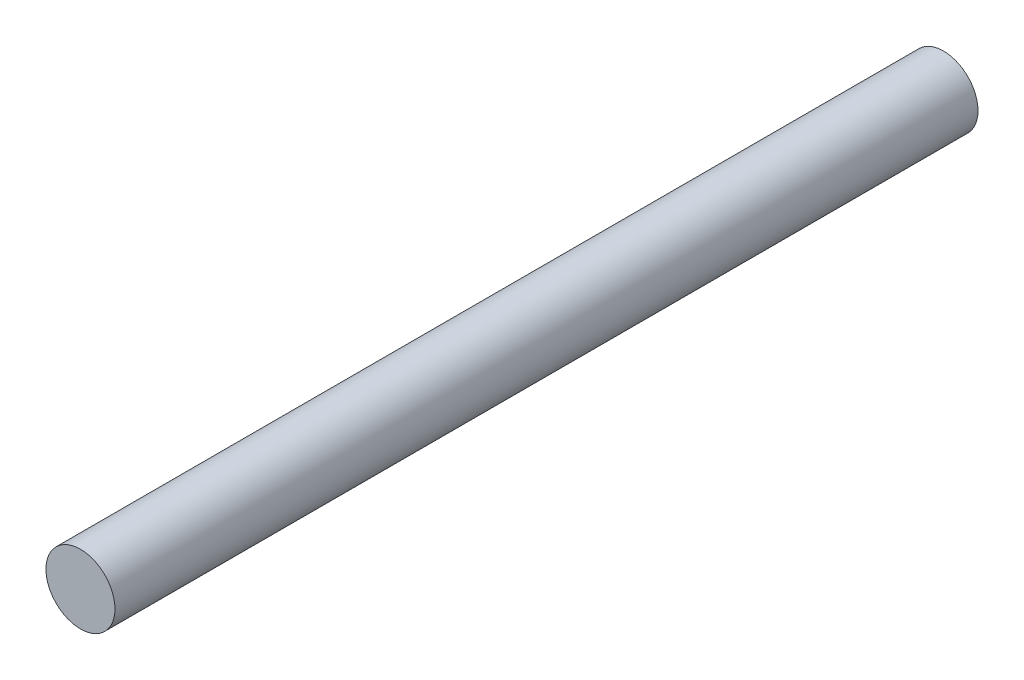
ISO-10303-21;
HEADER;
FILE_DESCRIPTION(('STEP AP214'),'2;1');
FILE_NAME('part.step','',(''),(''),'','','');
FILE_SCHEMA(('AUTOMOTIVE_DESIGN { 1 0 10303 214 1 1 1 1 }'));
ENDSEC;
DATA;
#1=APPLICATION_CONTEXT('core data for automotive mechanical design processes');
#2=APPLICATION_PROTOCOL_DEFINITION('international standard','automotive_design',2000,#1);
#3=PRODUCT_CONTEXT('',#1,'mechanical');
#4=PRODUCT('Part','Part','',(#3));
#5=PRODUCT_RELATED_PRODUCT_CATEGORY('part','',(#4));
#6=PRODUCT_DEFINITION_FORMATION('','',#4);
#7=PRODUCT_DEFINITION_CONTEXT('part definition',#1,'design');
#8=PRODUCT_DEFINITION('design','',#6,#7);
#9=PRODUCT_DEFINITION_SHAPE('','',#8);
#10=(LENGTH_UNIT() NAMED_UNIT(*) SI_UNIT(.MILLI.,.METRE.));
#11=(NAMED_UNIT(*) PLANE_ANGLE_UNIT() SI_UNIT($,.RADIAN.));
#12=(NAMED_UNIT(*) SI_UNIT($,.STERADIAN.) SOLID_ANGLE_UNIT());
#13=UNCERTAINTY_MEASURE_WITH_UNIT(LENGTH_MEASURE(1.E-05),#10,'distance_accuracy_value','');
#14=(GEOMETRIC_REPRESENTATION_CONTEXT(3) GLOBAL_UNCERTAINTY_ASSIGNED_CONTEXT((#13)) GLOBAL_UNIT_ASSIGNED_CONTEXT((#10,
#11,#12)) REPRESENTATION_CONTEXT('',''));
#15=CARTESIAN_POINT('',(0.,0.,0.));
#16=DIRECTION('',(0.,0.,1.));
#17=DIRECTION('',(1.,0.,0.));
#18=AXIS2_PLACEMENT_3D('',#15,#16,#17);
#19=CARTESIAN_POINT('',(-1.7555685511088,6.90778060327591,100.));
#20=DIRECTION('',(0.,0.,-1.));
#21=DIRECTION('',(-1.,0.,0.));
#22=AXIS2_PLACEMENT_3D('',#19,#20,#21);
#23=CYLINDRICAL_SURFACE('',#22,4.);
#24=CARTESIAN_POINT('',(-1.7555685511088,6.90778060327591,100.));
#25=DIRECTION('',(0.,0.,1.));
#26=DIRECTION('',(1.,0.,0.));
#27=AXIS2_PLACEMENT_3D('',#24,#25,#26);
#28=CIRCLE('',#27,4.);
#29=CARTESIAN_POINT('',(2.2444314488912,6.90778060327591,100.));
#30=VERTEX_POINT('',#29);
#31=EDGE_CURVE('E10',#30,#30,#28,.T.);
#32=ORIENTED_EDGE('',*,*,#31,.F.);
#33=EDGE_LOOP('',(#32));
#34=FACE_BOUND('',#33,.T.);
#35=CARTESIAN_POINT('',(-1.7555685511088,6.90778060327591,0.));
#36=DIRECTION('',(0.,0.,1.));
#37=DIRECTION('',(1.,0.,0.));
#38=AXIS2_PLACEMENT_3D('',#35,#36,#37);
#39=CIRCLE('',#38,4.);
#40=CARTESIAN_POINT('',(2.2444314488912,6.90778060327591,0.));
#41=VERTEX_POINT('',#40);
#42=EDGE_CURVE('E36',#41,#41,#39,.T.);
#43=ORIENTED_EDGE('',*,*,#42,.T.);
#44=EDGE_LOOP('',(#43));
#45=FACE_BOUND('',#44,.T.);
#46=ADVANCED_FACE('F33',(#34,#45),#23,.T.);
#47=CARTESIAN_POINT('',(-1.7555685511088,6.90778060327591,100.));
#48=DIRECTION('',(0.,0.,1.));
#49=DIRECTION('',(1.,0.,0.));
#50=AXIS2_PLACEMENT_3D('',#47,#48,#49);
#51=PLANE('',#50);
#52=ORIENTED_EDGE('',*,*,#31,.T.);
#53=EDGE_LOOP('',(#52));
#54=FACE_BOUND('',#53,.T.);
#55=ADVANCED_FACE('F48',(#54),#51,.T.);
#56=CARTESIAN_POINT('',(-1.7555685511088,6.90778060327591,0.));
#57=DIRECTION('',(0.,0.,1.));
#58=DIRECTION('',(1.,0.,0.));
#59=AXIS2_PLACEMENT_3D('',#56,#57,#58);
#60=PLANE('',#59);
#61=ORIENTED_EDGE('',*,*,#42,.F.);
#62=EDGE_LOOP('',(#61));
#63=FACE_BOUND('',#62,.T.);
#64=ADVANCED_FACE('F46',(#63),#60,.F.);
#65=CLOSED_SHELL('',(#46,#55,#64));
#66=MANIFOLD_SOLID_BREP('B2',#65);
#67=ADVANCED_BREP_SHAPE_REPRESENTATION('',(#18,#66),#14);
#68=SHAPE_DEFINITION_REPRESENTATION(#9,#67);
ENDSEC;
END-ISO-10303-21;
